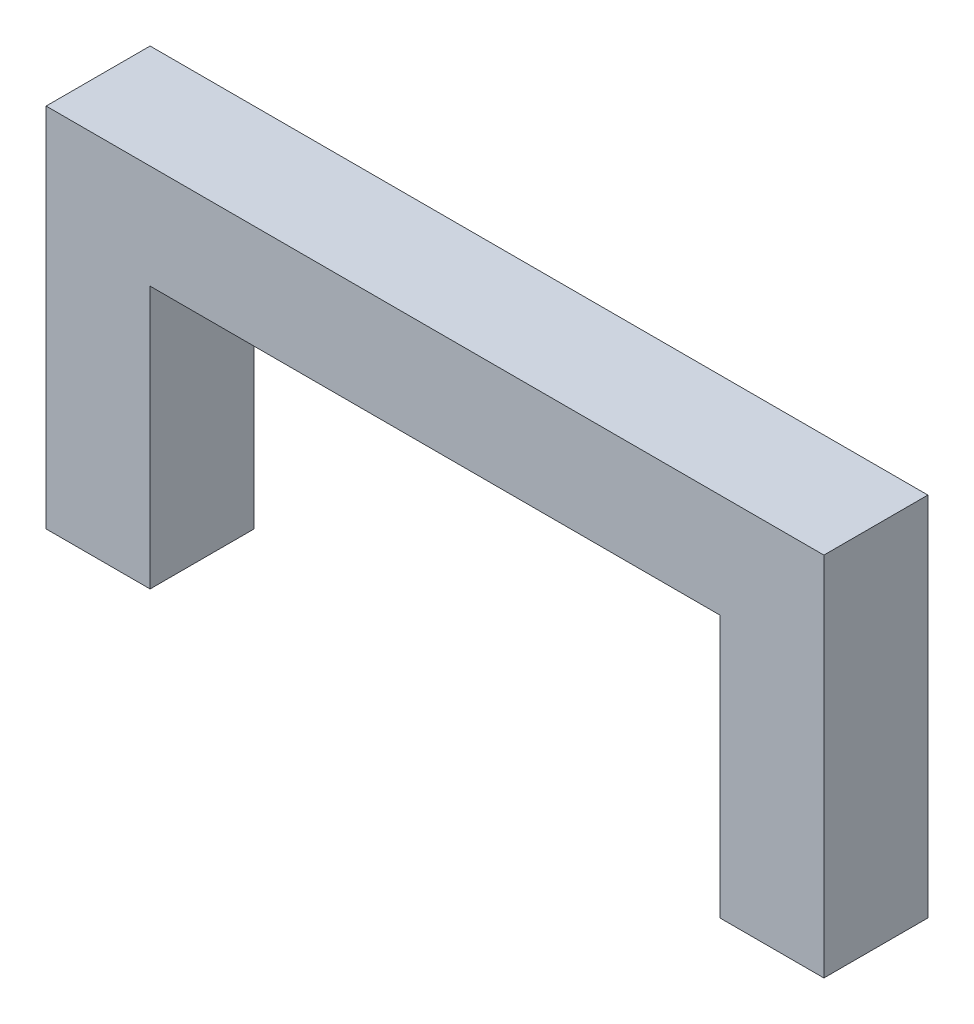
ISO-10303-21;
HEADER;
FILE_DESCRIPTION(('STEP AP214'),'2;1');
FILE_NAME('part.step','',(''),(''),'','','');
FILE_SCHEMA(('AUTOMOTIVE_DESIGN { 1 0 10303 214 1 1 1 1 }'));
ENDSEC;
DATA;
#1=APPLICATION_CONTEXT('core data for automotive mechanical design processes');
#2=APPLICATION_PROTOCOL_DEFINITION('international standard','automotive_design',2000,#1);
#3=PRODUCT_CONTEXT('',#1,'mechanical');
#4=PRODUCT('Part','Part','',(#3));
#5=PRODUCT_RELATED_PRODUCT_CATEGORY('part','',(#4));
#6=PRODUCT_DEFINITION_FORMATION('','',#4);
#7=PRODUCT_DEFINITION_CONTEXT('part definition',#1,'design');
#8=PRODUCT_DEFINITION('design','',#6,#7);
#9=PRODUCT_DEFINITION_SHAPE('','',#8);
#10=(LENGTH_UNIT() NAMED_UNIT(*) SI_UNIT(.MILLI.,.METRE.));
#11=(NAMED_UNIT(*) PLANE_ANGLE_UNIT() SI_UNIT($,.RADIAN.));
#12=(NAMED_UNIT(*) SI_UNIT($,.STERADIAN.) SOLID_ANGLE_UNIT());
#13=UNCERTAINTY_MEASURE_WITH_UNIT(LENGTH_MEASURE(1.E-05),#10,'distance_accuracy_value','');
#14=(GEOMETRIC_REPRESENTATION_CONTEXT(3) GLOBAL_UNCERTAINTY_ASSIGNED_CONTEXT((#13)) GLOBAL_UNIT_ASSIGNED_CONTEXT((#10,
#11,#12)) REPRESENTATION_CONTEXT('',''));
#15=CARTESIAN_POINT('',(0.,0.,0.));
#16=DIRECTION('',(0.,0.,1.));
#17=DIRECTION('',(1.,0.,0.));
#18=AXIS2_PLACEMENT_3D('',#15,#16,#17);
#19=CARTESIAN_POINT('',(0.,48.05,0.));
#20=DIRECTION('',(0.,1.,0.));
#21=DIRECTION('',(0.,0.,1.));
#22=AXIS2_PLACEMENT_3D('',#19,#20,#21);
#23=PLANE('',#22);
#24=DIRECTION('',(0.,0.,1.));
#25=VECTOR('',#24,1.);
#26=CARTESIAN_POINT('',(123.44,48.05,19.05));
#27=LINE('',#26,#25);
#28=CARTESIAN_POINT('',(123.44,48.05,0.));
#29=VERTEX_POINT('',#28);
#30=CARTESIAN_POINT('',(123.44,48.05,19.05));
#31=VERTEX_POINT('',#30);
#32=EDGE_CURVE('E155',#29,#31,#27,.T.);
#33=ORIENTED_EDGE('',*,*,#32,.T.);
#34=DIRECTION('',(1.,0.,0.));
#35=VECTOR('',#34,1.);
#36=CARTESIAN_POINT('',(0.,48.05,19.05));
#37=LINE('',#36,#35);
#38=CARTESIAN_POINT('',(19.05,48.05,19.05));
#39=VERTEX_POINT('',#38);
#40=EDGE_CURVE('E120',#39,#31,#37,.T.);
#41=ORIENTED_EDGE('',*,*,#40,.F.);
#42=DIRECTION('',(0.,0.,-1.));
#43=VECTOR('',#42,1.);
#44=CARTESIAN_POINT('',(19.05,48.05,0.));
#45=LINE('',#44,#43);
#46=CARTESIAN_POINT('',(19.05,48.05,0.));
#47=VERTEX_POINT('',#46);
#48=EDGE_CURVE('E88',#39,#47,#45,.T.);
#49=ORIENTED_EDGE('',*,*,#48,.T.);
#50=DIRECTION('',(-1.,0.,0.));
#51=VECTOR('',#50,1.);
#52=CARTESIAN_POINT('',(0.,48.05,0.));
#53=LINE('',#52,#51);
#54=EDGE_CURVE('E81',#29,#47,#53,.T.);
#55=ORIENTED_EDGE('',*,*,#54,.F.);
#56=EDGE_LOOP('',(#33,#41,#49,#55));
#57=FACE_BOUND('',#56,.T.);
#58=ADVANCED_FACE('F33',(#57),#23,.F.);
#59=CARTESIAN_POINT('',(0.,48.05,0.));
#60=DIRECTION('',(1.,0.,0.));
#61=DIRECTION('',(0.,0.,-1.));
#62=AXIS2_PLACEMENT_3D('',#59,#60,#61);
#63=PLANE('',#62);
#64=DIRECTION('',(0.,0.,1.));
#65=VECTOR('',#64,1.);
#66=CARTESIAN_POINT('',(0.,0.,0.));
#67=LINE('',#66,#65);
#68=CARTESIAN_POINT('',(0.,0.,0.));
#69=VERTEX_POINT('',#68);
#70=CARTESIAN_POINT('',(0.,0.,19.05));
#71=VERTEX_POINT('',#70);
#72=EDGE_CURVE('E87',#69,#71,#67,.T.);
#73=ORIENTED_EDGE('',*,*,#72,.T.);
#74=DIRECTION('',(0.,-1.,0.));
#75=VECTOR('',#74,1.);
#76=CARTESIAN_POINT('',(0.,48.05,19.05));
#77=LINE('',#76,#75);
#78=CARTESIAN_POINT('',(0.,67.1,19.05));
#79=VERTEX_POINT('',#78);
#80=EDGE_CURVE('E11',#79,#71,#77,.T.);
#81=ORIENTED_EDGE('',*,*,#80,.F.);
#82=DIRECTION('',(0.,0.,1.));
#83=VECTOR('',#82,1.);
#84=CARTESIAN_POINT('',(0.,67.1,0.));
#85=LINE('',#84,#83);
#86=CARTESIAN_POINT('',(0.,67.1,0.));
#87=VERTEX_POINT('',#86);
#88=EDGE_CURVE('E98',#87,#79,#85,.T.);
#89=ORIENTED_EDGE('',*,*,#88,.F.);
#90=DIRECTION('',(0.,-1.,0.));
#91=VECTOR('',#90,1.);
#92=CARTESIAN_POINT('',(0.,48.05,0.));
#93=LINE('',#92,#91);
#94=EDGE_CURVE('E82',#87,#69,#93,.T.);
#95=ORIENTED_EDGE('',*,*,#94,.T.);
#96=EDGE_LOOP('',(#73,#81,#89,#95));
#97=FACE_BOUND('',#96,.T.);
#98=ADVANCED_FACE('F35',(#97),#63,.F.);
#99=CARTESIAN_POINT('',(0.,48.05,19.05));
#100=DIRECTION('',(0.,0.,-1.));
#101=DIRECTION('',(-1.,0.,0.));
#102=AXIS2_PLACEMENT_3D('',#99,#100,#101);
#103=PLANE('',#102);
#104=DIRECTION('',(1.,0.,0.));
#105=VECTOR('',#104,1.);
#106=CARTESIAN_POINT('',(0.,0.,19.05));
#107=LINE('',#106,#105);
#108=CARTESIAN_POINT('',(19.05,0.,19.05));
#109=VERTEX_POINT('',#108);
#110=EDGE_CURVE('E72',#71,#109,#107,.T.);
#111=ORIENTED_EDGE('',*,*,#110,.T.);
#112=DIRECTION('',(0.,-1.,0.));
#113=VECTOR('',#112,1.);
#114=CARTESIAN_POINT('',(19.05,48.05,19.05));
#115=LINE('',#114,#113);
#116=EDGE_CURVE('E42',#39,#109,#115,.T.);
#117=ORIENTED_EDGE('',*,*,#116,.F.);
#118=ORIENTED_EDGE('',*,*,#40,.T.);
#119=DIRECTION('',(0.,-1.,0.));
#120=VECTOR('',#119,1.);
#121=CARTESIAN_POINT('',(123.44,48.05,19.05));
#122=LINE('',#121,#120);
#123=CARTESIAN_POINT('',(123.44,0.,19.05));
#124=VERTEX_POINT('',#123);
#125=EDGE_CURVE('E122',#31,#124,#122,.T.);
#126=ORIENTED_EDGE('',*,*,#125,.T.);
#127=DIRECTION('',(1.,0.,0.));
#128=VECTOR('',#127,1.);
#129=CARTESIAN_POINT('',(142.49,0.,19.05));
#130=LINE('',#129,#128);
#131=CARTESIAN_POINT('',(142.49,0.,19.05));
#132=VERTEX_POINT('',#131);
#133=EDGE_CURVE('E170',#124,#132,#130,.T.);
#134=ORIENTED_EDGE('',*,*,#133,.T.);
#135=DIRECTION('',(0.,-1.,0.));
#136=VECTOR('',#135,1.);
#137=CARTESIAN_POINT('',(142.49,67.1,19.05));
#138=LINE('',#137,#136);
#139=CARTESIAN_POINT('',(142.49,67.1,19.05));
#140=VERTEX_POINT('',#139);
#141=EDGE_CURVE('E114',#140,#132,#138,.T.);
#142=ORIENTED_EDGE('',*,*,#141,.F.);
#143=DIRECTION('',(1.,0.,0.));
#144=VECTOR('',#143,1.);
#145=CARTESIAN_POINT('',(0.,67.1,19.05));
#146=LINE('',#145,#144);
#147=EDGE_CURVE('E116',#79,#140,#146,.T.);
#148=ORIENTED_EDGE('',*,*,#147,.F.);
#149=ORIENTED_EDGE('',*,*,#80,.T.);
#150=EDGE_LOOP('',(#111,#117,#118,#126,#134,#142,#148,#149));
#151=FACE_BOUND('',#150,.T.);
#152=ADVANCED_FACE('F126',(#151),#103,.F.);
#153=CARTESIAN_POINT('',(19.05,48.05,0.));
#154=DIRECTION('',(-1.,0.,0.));
#155=DIRECTION('',(0.,0.,1.));
#156=AXIS2_PLACEMENT_3D('',#153,#154,#155);
#157=PLANE('',#156);
#158=DIRECTION('',(0.,0.,-1.));
#159=VECTOR('',#158,1.);
#160=CARTESIAN_POINT('',(19.05,0.,0.));
#161=LINE('',#160,#159);
#162=CARTESIAN_POINT('',(19.05,0.,0.));
#163=VERTEX_POINT('',#162);
#164=EDGE_CURVE('E64',#109,#163,#161,.T.);
#165=ORIENTED_EDGE('',*,*,#164,.T.);
#166=DIRECTION('',(0.,-1.,0.));
#167=VECTOR('',#166,1.);
#168=CARTESIAN_POINT('',(19.05,48.05,0.));
#169=LINE('',#168,#167);
#170=EDGE_CURVE('E67',#47,#163,#169,.T.);
#171=ORIENTED_EDGE('',*,*,#170,.F.);
#172=ORIENTED_EDGE('',*,*,#48,.F.);
#173=ORIENTED_EDGE('',*,*,#116,.T.);
#174=EDGE_LOOP('',(#165,#171,#172,#173));
#175=FACE_BOUND('',#174,.T.);
#176=ADVANCED_FACE('F66',(#175),#157,.F.);
#177=CARTESIAN_POINT('',(0.,48.05,0.));
#178=DIRECTION('',(0.,0.,1.));
#179=DIRECTION('',(1.,0.,0.));
#180=AXIS2_PLACEMENT_3D('',#177,#178,#179);
#181=PLANE('',#180);
#182=DIRECTION('',(-1.,0.,0.));
#183=VECTOR('',#182,1.);
#184=CARTESIAN_POINT('',(0.,0.,0.));
#185=LINE('',#184,#183);
#186=EDGE_CURVE('E71',#163,#69,#185,.T.);
#187=ORIENTED_EDGE('',*,*,#186,.T.);
#188=ORIENTED_EDGE('',*,*,#94,.F.);
#189=DIRECTION('',(-1.,0.,0.));
#190=VECTOR('',#189,1.);
#191=CARTESIAN_POINT('',(0.,67.1,0.));
#192=LINE('',#191,#190);
#193=CARTESIAN_POINT('',(142.49,67.1,0.));
#194=VERTEX_POINT('',#193);
#195=EDGE_CURVE('E103',#194,#87,#192,.T.);
#196=ORIENTED_EDGE('',*,*,#195,.F.);
#197=DIRECTION('',(0.,-1.,0.));
#198=VECTOR('',#197,1.);
#199=CARTESIAN_POINT('',(142.49,67.1,0.));
#200=LINE('',#199,#198);
#201=CARTESIAN_POINT('',(142.49,0.,0.));
#202=VERTEX_POINT('',#201);
#203=EDGE_CURVE('E112',#194,#202,#200,.T.);
#204=ORIENTED_EDGE('',*,*,#203,.T.);
#205=DIRECTION('',(-1.,0.,0.));
#206=VECTOR('',#205,1.);
#207=CARTESIAN_POINT('',(142.49,0.,0.));
#208=LINE('',#207,#206);
#209=CARTESIAN_POINT('',(123.44,0.,0.));
#210=VERTEX_POINT('',#209);
#211=EDGE_CURVE('E163',#202,#210,#208,.T.);
#212=ORIENTED_EDGE('',*,*,#211,.T.);
#213=DIRECTION('',(0.,-1.,0.));
#214=VECTOR('',#213,1.);
#215=CARTESIAN_POINT('',(123.44,48.05,0.));
#216=LINE('',#215,#214);
#217=EDGE_CURVE('E159',#29,#210,#216,.T.);
#218=ORIENTED_EDGE('',*,*,#217,.F.);
#219=ORIENTED_EDGE('',*,*,#54,.T.);
#220=ORIENTED_EDGE('',*,*,#170,.T.);
#221=EDGE_LOOP('',(#187,#188,#196,#204,#212,#218,#219,#220));
#222=FACE_BOUND('',#221,.T.);
#223=ADVANCED_FACE('F76',(#222),#181,.F.);
#224=CARTESIAN_POINT('',(0.,0.,0.));
#225=DIRECTION('',(0.,1.,0.));
#226=DIRECTION('',(0.,0.,1.));
#227=AXIS2_PLACEMENT_3D('',#224,#225,#226);
#228=PLANE('',#227);
#229=ORIENTED_EDGE('',*,*,#72,.F.);
#230=ORIENTED_EDGE('',*,*,#186,.F.);
#231=ORIENTED_EDGE('',*,*,#164,.F.);
#232=ORIENTED_EDGE('',*,*,#110,.F.);
#233=EDGE_LOOP('',(#229,#230,#231,#232));
#234=FACE_BOUND('',#233,.T.);
#235=ADVANCED_FACE('F85',(#234),#228,.F.);
#236=CARTESIAN_POINT('',(142.49,67.1,0.));
#237=DIRECTION('',(-1.,0.,0.));
#238=DIRECTION('',(0.,0.,1.));
#239=AXIS2_PLACEMENT_3D('',#236,#237,#238);
#240=PLANE('',#239);
#241=ORIENTED_EDGE('',*,*,#141,.T.);
#242=DIRECTION('',(0.,0.,-1.));
#243=VECTOR('',#242,1.);
#244=CARTESIAN_POINT('',(142.49,0.,19.05));
#245=LINE('',#244,#243);
#246=EDGE_CURVE('E166',#132,#202,#245,.T.);
#247=ORIENTED_EDGE('',*,*,#246,.T.);
#248=ORIENTED_EDGE('',*,*,#203,.F.);
#249=DIRECTION('',(0.,0.,-1.));
#250=VECTOR('',#249,1.);
#251=CARTESIAN_POINT('',(142.49,67.1,0.));
#252=LINE('',#251,#250);
#253=EDGE_CURVE('E110',#140,#194,#252,.T.);
#254=ORIENTED_EDGE('',*,*,#253,.F.);
#255=EDGE_LOOP('',(#241,#247,#248,#254));
#256=FACE_BOUND('',#255,.T.);
#257=ADVANCED_FACE('F176',(#256),#240,.F.);
#258=CARTESIAN_POINT('',(0.,67.1,0.));
#259=DIRECTION('',(0.,1.,0.));
#260=DIRECTION('',(0.,0.,1.));
#261=AXIS2_PLACEMENT_3D('',#258,#259,#260);
#262=PLANE('',#261);
#263=ORIENTED_EDGE('',*,*,#88,.T.);
#264=ORIENTED_EDGE('',*,*,#147,.T.);
#265=ORIENTED_EDGE('',*,*,#253,.T.);
#266=ORIENTED_EDGE('',*,*,#195,.T.);
#267=EDGE_LOOP('',(#263,#264,#265,#266));
#268=FACE_BOUND('',#267,.T.);
#269=ADVANCED_FACE('F106',(#268),#262,.T.);
#270=CARTESIAN_POINT('',(123.44,48.05,19.05));
#271=DIRECTION('',(1.,0.,0.));
#272=DIRECTION('',(0.,0.,-1.));
#273=AXIS2_PLACEMENT_3D('',#270,#271,#272);
#274=PLANE('',#273);
#275=DIRECTION('',(0.,0.,1.));
#276=VECTOR('',#275,1.);
#277=CARTESIAN_POINT('',(123.44,0.,19.05));
#278=LINE('',#277,#276);
#279=EDGE_CURVE('E157',#210,#124,#278,.T.);
#280=ORIENTED_EDGE('',*,*,#279,.T.);
#281=ORIENTED_EDGE('',*,*,#125,.F.);
#282=ORIENTED_EDGE('',*,*,#32,.F.);
#283=ORIENTED_EDGE('',*,*,#217,.T.);
#284=EDGE_LOOP('',(#280,#281,#282,#283));
#285=FACE_BOUND('',#284,.T.);
#286=ADVANCED_FACE('F153',(#285),#274,.F.);
#287=CARTESIAN_POINT('',(0.,0.,0.));
#288=DIRECTION('',(0.,1.,0.));
#289=DIRECTION('',(0.,0.,1.));
#290=AXIS2_PLACEMENT_3D('',#287,#288,#289);
#291=PLANE('',#290);
#292=ORIENTED_EDGE('',*,*,#279,.F.);
#293=ORIENTED_EDGE('',*,*,#211,.F.);
#294=ORIENTED_EDGE('',*,*,#246,.F.);
#295=ORIENTED_EDGE('',*,*,#133,.F.);
#296=EDGE_LOOP('',(#292,#293,#294,#295));
#297=FACE_BOUND('',#296,.T.);
#298=ADVANCED_FACE('F179',(#297),#291,.F.);
#299=CLOSED_SHELL('',(#58,#98,#152,#176,#223,#235,#257,#269,#286,#298));
#300=MANIFOLD_SOLID_BREP('B2',#299);
#301=ADVANCED_BREP_SHAPE_REPRESENTATION('',(#18,#300),#14);
#302=SHAPE_DEFINITION_REPRESENTATION(#9,#301);
ENDSEC;
END-ISO-10303-21;
